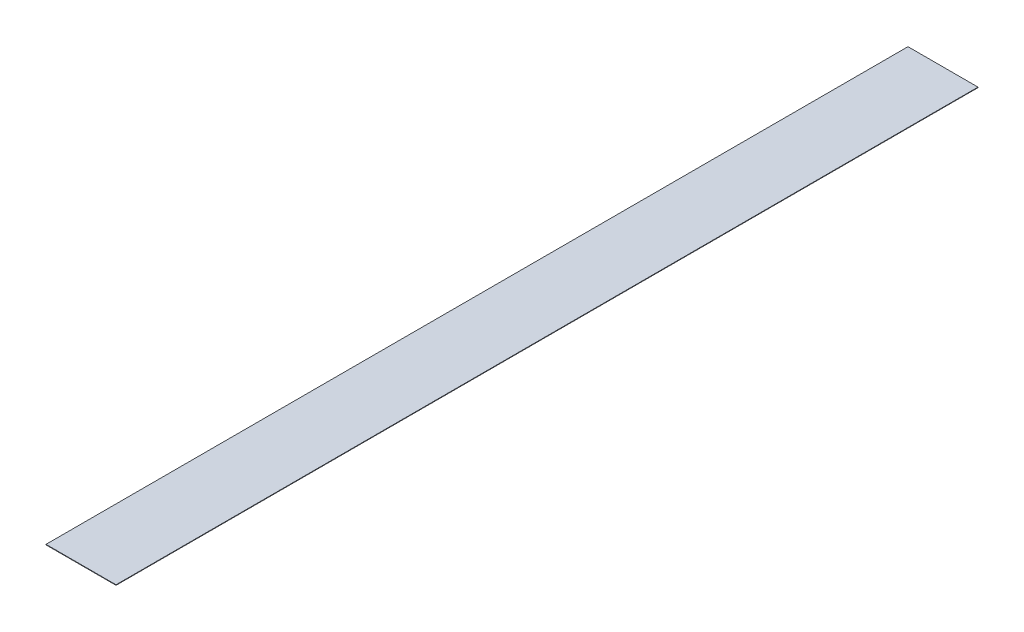
ISO-10303-21;
HEADER;
FILE_DESCRIPTION(('STEP AP214'),'2;1');
FILE_NAME('part.step','',(''),(''),'','','');
FILE_SCHEMA(('AUTOMOTIVE_DESIGN { 1 0 10303 214 1 1 1 1 }'));
ENDSEC;
DATA;
#1=APPLICATION_CONTEXT('core data for automotive mechanical design processes');
#2=APPLICATION_PROTOCOL_DEFINITION('international standard','automotive_design',2000,#1);
#3=PRODUCT_CONTEXT('',#1,'mechanical');
#4=PRODUCT('Part','Part','',(#3));
#5=PRODUCT_RELATED_PRODUCT_CATEGORY('part','',(#4));
#6=PRODUCT_DEFINITION_FORMATION('','',#4);
#7=PRODUCT_DEFINITION_CONTEXT('part definition',#1,'design');
#8=PRODUCT_DEFINITION('design','',#6,#7);
#9=PRODUCT_DEFINITION_SHAPE('','',#8);
#10=(LENGTH_UNIT() NAMED_UNIT(*) SI_UNIT(.MILLI.,.METRE.));
#11=(NAMED_UNIT(*) PLANE_ANGLE_UNIT() SI_UNIT($,.RADIAN.));
#12=(NAMED_UNIT(*) SI_UNIT($,.STERADIAN.) SOLID_ANGLE_UNIT());
#13=UNCERTAINTY_MEASURE_WITH_UNIT(LENGTH_MEASURE(1.E-05),#10,'distance_accuracy_value','');
#14=(GEOMETRIC_REPRESENTATION_CONTEXT(3) GLOBAL_UNCERTAINTY_ASSIGNED_CONTEXT((#13)) GLOBAL_UNIT_ASSIGNED_CONTEXT((#10,
#11,#12)) REPRESENTATION_CONTEXT('',''));
#15=CARTESIAN_POINT('',(0.,0.,0.));
#16=DIRECTION('',(0.,0.,1.));
#17=DIRECTION('',(1.,0.,0.));
#18=AXIS2_PLACEMENT_3D('',#15,#16,#17);
#19=CARTESIAN_POINT('',(-12.45,0.175,-153.25));
#20=DIRECTION('',(1.,0.,0.));
#21=DIRECTION('',(0.,0.,-1.));
#22=AXIS2_PLACEMENT_3D('',#19,#20,#21);
#23=PLANE('',#22);
#24=DIRECTION('',(0.,0.,1.));
#25=VECTOR('',#24,1.);
#26=CARTESIAN_POINT('',(-12.45,0.,-153.25));
#27=LINE('',#26,#25);
#28=CARTESIAN_POINT('',(-12.45,0.,-153.25));
#29=VERTEX_POINT('',#28);
#30=CARTESIAN_POINT('',(-12.45,0.,153.25));
#31=VERTEX_POINT('',#30);
#32=EDGE_CURVE('E96',#29,#31,#27,.T.);
#33=ORIENTED_EDGE('',*,*,#32,.T.);
#34=DIRECTION('',(0.,-1.,0.));
#35=VECTOR('',#34,1.);
#36=CARTESIAN_POINT('',(-12.45,0.175,153.25));
#37=LINE('',#36,#35);
#38=CARTESIAN_POINT('',(-12.45,0.175,153.25));
#39=VERTEX_POINT('',#38);
#40=EDGE_CURVE('E11',#39,#31,#37,.T.);
#41=ORIENTED_EDGE('',*,*,#40,.F.);
#42=DIRECTION('',(0.,0.,1.));
#43=VECTOR('',#42,1.);
#44=CARTESIAN_POINT('',(-12.45,0.175,-153.25));
#45=LINE('',#44,#43);
#46=CARTESIAN_POINT('',(-12.45,0.175,-153.25));
#47=VERTEX_POINT('',#46);
#48=EDGE_CURVE('E84',#47,#39,#45,.T.);
#49=ORIENTED_EDGE('',*,*,#48,.F.);
#50=DIRECTION('',(0.,-1.,0.));
#51=VECTOR('',#50,1.);
#52=CARTESIAN_POINT('',(-12.45,0.175,-153.25));
#53=LINE('',#52,#51);
#54=EDGE_CURVE('E92',#47,#29,#53,.T.);
#55=ORIENTED_EDGE('',*,*,#54,.T.);
#56=EDGE_LOOP('',(#33,#41,#49,#55));
#57=FACE_BOUND('',#56,.T.);
#58=ADVANCED_FACE('F33',(#57),#23,.F.);
#59=CARTESIAN_POINT('',(-12.45,0.175,153.25));
#60=DIRECTION('',(0.,0.,-1.));
#61=DIRECTION('',(-1.,0.,0.));
#62=AXIS2_PLACEMENT_3D('',#59,#60,#61);
#63=PLANE('',#62);
#64=DIRECTION('',(1.,0.,0.));
#65=VECTOR('',#64,1.);
#66=CARTESIAN_POINT('',(-12.45,0.,153.25));
#67=LINE('',#66,#65);
#68=CARTESIAN_POINT('',(12.45,0.,153.25));
#69=VERTEX_POINT('',#68);
#70=EDGE_CURVE('E88',#31,#69,#67,.T.);
#71=ORIENTED_EDGE('',*,*,#70,.T.);
#72=DIRECTION('',(0.,-1.,0.));
#73=VECTOR('',#72,1.);
#74=CARTESIAN_POINT('',(12.45,0.175,153.25));
#75=LINE('',#74,#73);
#76=CARTESIAN_POINT('',(12.45,0.175,153.25));
#77=VERTEX_POINT('',#76);
#78=EDGE_CURVE('E41',#77,#69,#75,.T.);
#79=ORIENTED_EDGE('',*,*,#78,.F.);
#80=DIRECTION('',(1.,0.,0.));
#81=VECTOR('',#80,1.);
#82=CARTESIAN_POINT('',(-12.45,0.175,153.25));
#83=LINE('',#82,#81);
#84=EDGE_CURVE('E79',#39,#77,#83,.T.);
#85=ORIENTED_EDGE('',*,*,#84,.F.);
#86=ORIENTED_EDGE('',*,*,#40,.T.);
#87=EDGE_LOOP('',(#71,#79,#85,#86));
#88=FACE_BOUND('',#87,.T.);
#89=ADVANCED_FACE('F87',(#88),#63,.F.);
#90=CARTESIAN_POINT('',(12.45,0.175,-153.25));
#91=DIRECTION('',(-1.,0.,0.));
#92=DIRECTION('',(0.,0.,1.));
#93=AXIS2_PLACEMENT_3D('',#90,#91,#92);
#94=PLANE('',#93);
#95=DIRECTION('',(0.,0.,-1.));
#96=VECTOR('',#95,1.);
#97=CARTESIAN_POINT('',(12.45,0.,-153.25));
#98=LINE('',#97,#96);
#99=CARTESIAN_POINT('',(12.45,0.,-153.25));
#100=VERTEX_POINT('',#99);
#101=EDGE_CURVE('E66',#69,#100,#98,.T.);
#102=ORIENTED_EDGE('',*,*,#101,.T.);
#103=DIRECTION('',(0.,-1.,0.));
#104=VECTOR('',#103,1.);
#105=CARTESIAN_POINT('',(12.45,0.175,-153.25));
#106=LINE('',#105,#104);
#107=CARTESIAN_POINT('',(12.45,0.175,-153.25));
#108=VERTEX_POINT('',#107);
#109=EDGE_CURVE('E89',#108,#100,#106,.T.);
#110=ORIENTED_EDGE('',*,*,#109,.F.);
#111=DIRECTION('',(0.,0.,-1.));
#112=VECTOR('',#111,1.);
#113=CARTESIAN_POINT('',(12.45,0.175,-153.25));
#114=LINE('',#113,#112);
#115=EDGE_CURVE('E82',#77,#108,#114,.T.);
#116=ORIENTED_EDGE('',*,*,#115,.F.);
#117=ORIENTED_EDGE('',*,*,#78,.T.);
#118=EDGE_LOOP('',(#102,#110,#116,#117));
#119=FACE_BOUND('',#118,.T.);
#120=ADVANCED_FACE('F90',(#119),#94,.F.);
#121=CARTESIAN_POINT('',(-12.45,0.175,-153.25));
#122=DIRECTION('',(0.,0.,1.));
#123=DIRECTION('',(1.,0.,0.));
#124=AXIS2_PLACEMENT_3D('',#121,#122,#123);
#125=PLANE('',#124);
#126=DIRECTION('',(-1.,0.,0.));
#127=VECTOR('',#126,1.);
#128=CARTESIAN_POINT('',(-12.45,0.,-153.25));
#129=LINE('',#128,#127);
#130=EDGE_CURVE('E72',#100,#29,#129,.T.);
#131=ORIENTED_EDGE('',*,*,#130,.T.);
#132=ORIENTED_EDGE('',*,*,#54,.F.);
#133=DIRECTION('',(-1.,0.,0.));
#134=VECTOR('',#133,1.);
#135=CARTESIAN_POINT('',(-12.45,0.175,-153.25));
#136=LINE('',#135,#134);
#137=EDGE_CURVE('E49',#108,#47,#136,.T.);
#138=ORIENTED_EDGE('',*,*,#137,.F.);
#139=ORIENTED_EDGE('',*,*,#109,.T.);
#140=EDGE_LOOP('',(#131,#132,#138,#139));
#141=FACE_BOUND('',#140,.T.);
#142=ADVANCED_FACE('F103',(#141),#125,.F.);
#143=CARTESIAN_POINT('',(-12.45,0.175,153.25));
#144=DIRECTION('',(0.,1.,0.));
#145=DIRECTION('',(0.,0.,1.));
#146=AXIS2_PLACEMENT_3D('',#143,#144,#145);
#147=PLANE('',#146);
#148=ORIENTED_EDGE('',*,*,#48,.T.);
#149=ORIENTED_EDGE('',*,*,#84,.T.);
#150=ORIENTED_EDGE('',*,*,#115,.T.);
#151=ORIENTED_EDGE('',*,*,#137,.T.);
#152=EDGE_LOOP('',(#148,#149,#150,#151));
#153=FACE_BOUND('',#152,.T.);
#154=ADVANCED_FACE('F80',(#153),#147,.T.);
#155=CARTESIAN_POINT('',(-12.45,0.,153.25));
#156=DIRECTION('',(0.,1.,0.));
#157=DIRECTION('',(0.,0.,1.));
#158=AXIS2_PLACEMENT_3D('',#155,#156,#157);
#159=PLANE('',#158);
#160=ORIENTED_EDGE('',*,*,#32,.F.);
#161=ORIENTED_EDGE('',*,*,#130,.F.);
#162=ORIENTED_EDGE('',*,*,#101,.F.);
#163=ORIENTED_EDGE('',*,*,#70,.F.);
#164=EDGE_LOOP('',(#160,#161,#162,#163));
#165=FACE_BOUND('',#164,.T.);
#166=ADVANCED_FACE('F106',(#165),#159,.F.);
#167=CLOSED_SHELL('',(#58,#89,#120,#142,#154,#166));
#168=MANIFOLD_SOLID_BREP('B2',#167);
#169=ADVANCED_BREP_SHAPE_REPRESENTATION('',(#18,#168),#14);
#170=SHAPE_DEFINITION_REPRESENTATION(#9,#169);
ENDSEC;
END-ISO-10303-21;
